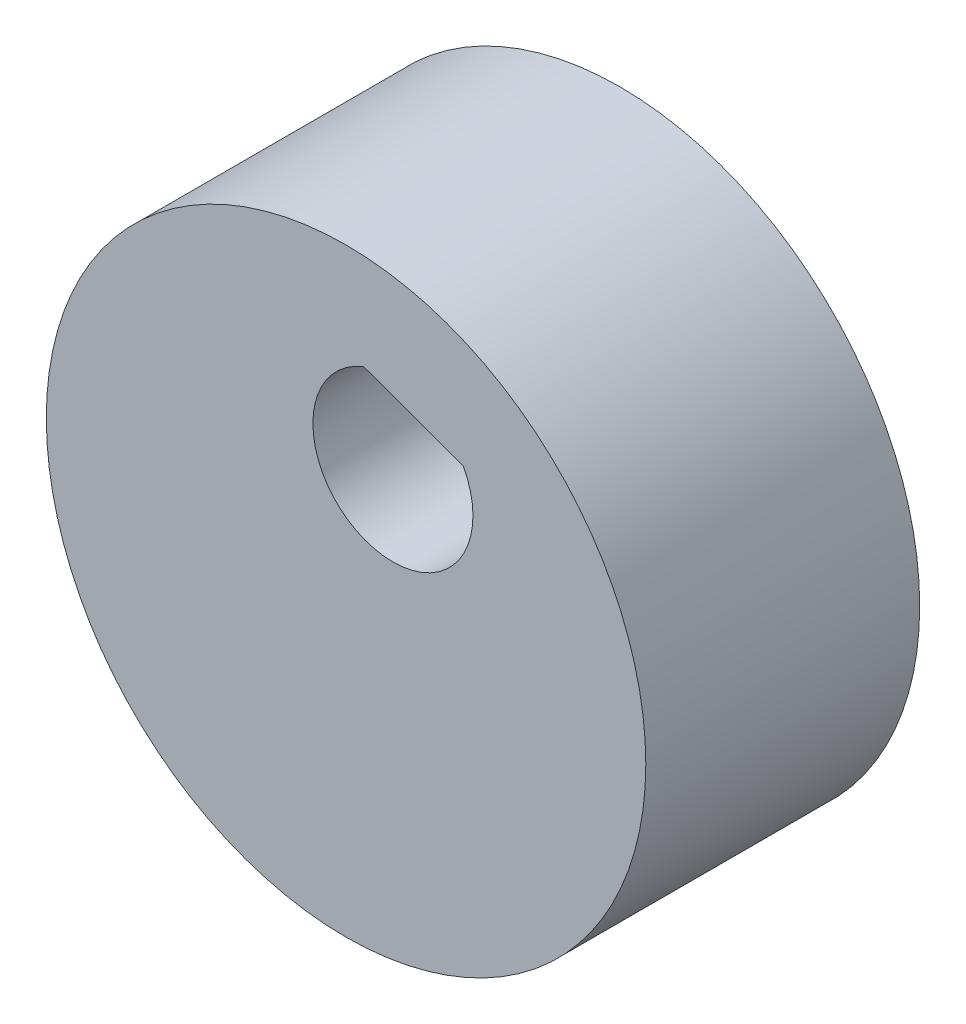
ISO-10303-21;
HEADER;
FILE_DESCRIPTION(('STEP AP214'),'2;1');
FILE_NAME('part.step','',(''),(''),'','','');
FILE_SCHEMA(('AUTOMOTIVE_DESIGN { 1 0 10303 214 1 1 1 1 }'));
ENDSEC;
DATA;
#1=APPLICATION_CONTEXT('core data for automotive mechanical design processes');
#2=APPLICATION_PROTOCOL_DEFINITION('international standard','automotive_design',2000,#1);
#3=PRODUCT_CONTEXT('',#1,'mechanical');
#4=PRODUCT('Part','Part','',(#3));
#5=PRODUCT_RELATED_PRODUCT_CATEGORY('part','',(#4));
#6=PRODUCT_DEFINITION_FORMATION('','',#4);
#7=PRODUCT_DEFINITION_CONTEXT('part definition',#1,'design');
#8=PRODUCT_DEFINITION('design','',#6,#7);
#9=PRODUCT_DEFINITION_SHAPE('','',#8);
#10=(LENGTH_UNIT() NAMED_UNIT(*) SI_UNIT(.MILLI.,.METRE.));
#11=(NAMED_UNIT(*) PLANE_ANGLE_UNIT() SI_UNIT($,.RADIAN.));
#12=(NAMED_UNIT(*) SI_UNIT($,.STERADIAN.) SOLID_ANGLE_UNIT());
#13=UNCERTAINTY_MEASURE_WITH_UNIT(LENGTH_MEASURE(1.E-05),#10,'distance_accuracy_value','');
#14=(GEOMETRIC_REPRESENTATION_CONTEXT(3) GLOBAL_UNCERTAINTY_ASSIGNED_CONTEXT((#13)) GLOBAL_UNIT_ASSIGNED_CONTEXT((#10,
#11,#12)) REPRESENTATION_CONTEXT('',''));
#15=CARTESIAN_POINT('',(0.,0.,0.));
#16=DIRECTION('',(0.,0.,1.));
#17=DIRECTION('',(1.,0.,0.));
#18=AXIS2_PLACEMENT_3D('',#15,#16,#17);
#19=CARTESIAN_POINT('',(-19.4680004808592,-35.2733524863187,90.6003228274378));
#20=DIRECTION('',(-0.342213757644624,-0.939622128346681,0.));
#21=DIRECTION('',(0.939622128346681,-0.342213757644624,0.));
#22=AXIS2_PLACEMENT_3D('',#19,#20,#21);
#23=PLANE('',#22);
#24=DIRECTION('',(0.,0.,-1.));
#25=VECTOR('',#24,1.);
#26=CARTESIAN_POINT('',(-21.1052094666073,-34.6770750869686,90.6003228274378));
#27=LINE('',#26,#25);
#28=CARTESIAN_POINT('',(-21.1052094666073,-34.6770750869686,62.7403156486879));
#29=VERTEX_POINT('',#28);
#30=CARTESIAN_POINT('',(-21.1052094666073,-34.6770750869686,54.7403156486879));
#31=VERTEX_POINT('',#30);
#32=EDGE_CURVE('E74',#29,#31,#27,.T.);
#33=ORIENTED_EDGE('',*,*,#32,.T.);
#34=DIRECTION('',(0.939622128346681,-0.342213757644624,0.));
#35=VECTOR('',#34,1.);
#36=CARTESIAN_POINT('',(-19.4680004808592,-35.2733524863187,54.7403156486879));
#37=LINE('',#36,#35);
#38=CARTESIAN_POINT('',(-17.8307914951058,-35.8696298856708,54.7403156486879));
#39=VERTEX_POINT('',#38);
#40=EDGE_CURVE('E65',#31,#39,#37,.T.);
#41=ORIENTED_EDGE('',*,*,#40,.T.);
#42=DIRECTION('',(0.,0.,-1.));
#43=VECTOR('',#42,1.);
#44=CARTESIAN_POINT('',(-17.8307914951058,-35.8696298856708,90.6003228274378));
#45=LINE('',#44,#43);
#46=CARTESIAN_POINT('',(-17.8307914951058,-35.8696298856708,62.7403156486879));
#47=VERTEX_POINT('',#46);
#48=EDGE_CURVE('E75',#47,#39,#45,.T.);
#49=ORIENTED_EDGE('',*,*,#48,.F.);
#50=DIRECTION('',(-0.939622128346681,0.342213757644624,0.));
#51=VECTOR('',#50,1.);
#52=CARTESIAN_POINT('',(-19.4680004808592,-35.2733524863187,62.7403156486879));
#53=LINE('',#52,#51);
#54=EDGE_CURVE('E11',#47,#29,#53,.T.);
#55=ORIENTED_EDGE('',*,*,#54,.T.);
#56=EDGE_LOOP('',(#33,#41,#49,#55));
#57=FACE_BOUND('',#56,.T.);
#58=ADVANCED_FACE('F39',(#57),#23,.T.);
#59=CARTESIAN_POINT('',(-21.6821234928173,-41.3527076567227,90.6003228274378));
#60=DIRECTION('',(0.,0.,-1.));
#61=DIRECTION('',(-1.,0.,0.));
#62=AXIS2_PLACEMENT_3D('',#59,#60,#61);
#63=CYLINDRICAL_SURFACE('',#62,9.85);
#64=CARTESIAN_POINT('',(-21.6821234928173,-41.3527076567227,53.7403156486879));
#65=DIRECTION('',(0.,0.,-1.));
#66=DIRECTION('',(-1.,0.,0.));
#67=AXIS2_PLACEMENT_3D('',#64,#65,#66);
#68=CIRCLE('',#67,9.85);
#69=CARTESIAN_POINT('',(-31.5321234928173,-41.3527076567227,53.7403156486879));
#70=VERTEX_POINT('',#69);
#71=EDGE_CURVE('E47',#70,#70,#68,.T.);
#72=ORIENTED_EDGE('',*,*,#71,.F.);
#73=EDGE_LOOP('',(#72));
#74=FACE_BOUND('',#73,.T.);
#75=CARTESIAN_POINT('',(-21.6821234928173,-41.3527076567227,62.7403156486879));
#76=DIRECTION('',(0.,0.,1.));
#77=DIRECTION('',(1.,0.,0.));
#78=AXIS2_PLACEMENT_3D('',#75,#76,#77);
#79=CIRCLE('',#78,9.85);
#80=CARTESIAN_POINT('',(-11.8321234928173,-41.3527076567227,62.7403156486879));
#81=VERTEX_POINT('',#80);
#82=EDGE_CURVE('E81',#81,#81,#79,.F.);
#83=ORIENTED_EDGE('',*,*,#82,.T.);
#84=EDGE_LOOP('',(#83));
#85=FACE_BOUND('',#84,.T.);
#86=ADVANCED_FACE('F41',(#74,#85),#63,.T.);
#87=CARTESIAN_POINT('',(-21.6821234928173,-41.3527076567227,53.7403156486879));
#88=DIRECTION('',(0.,0.,-1.));
#89=DIRECTION('',(-1.,0.,0.));
#90=AXIS2_PLACEMENT_3D('',#87,#88,#89);
#91=PLANE('',#90);
#92=CARTESIAN_POINT('',(-20.1421615834165,-37.1244080791627,53.7403156486879));
#93=DIRECTION('',(0.,0.,-1.));
#94=DIRECTION('',(-1.,0.,0.));
#95=AXIS2_PLACEMENT_3D('',#92,#93,#94);
#96=CIRCLE('',#95,2.63);
#97=CARTESIAN_POINT('',(-22.7721615834165,-37.1244080791627,53.7403156486879));
#98=VERTEX_POINT('',#97);
#99=EDGE_CURVE('E77',#98,#98,#96,.T.);
#100=ORIENTED_EDGE('',*,*,#99,.F.);
#101=EDGE_LOOP('',(#100));
#102=FACE_BOUND('',#101,.T.);
#103=ORIENTED_EDGE('',*,*,#71,.T.);
#104=EDGE_LOOP('',(#103));
#105=FACE_BOUND('',#104,.T.);
#106=ADVANCED_FACE('F86',(#102,#105),#91,.T.);
#107=CARTESIAN_POINT('',(-20.1421615834165,-37.1244080791627,90.6003228274378));
#108=DIRECTION('',(0.,0.,-1.));
#109=DIRECTION('',(-1.,0.,0.));
#110=AXIS2_PLACEMENT_3D('',#107,#108,#109);
#111=CYLINDRICAL_SURFACE('',#110,2.63);
#112=ORIENTED_EDGE('',*,*,#99,.T.);
#113=EDGE_LOOP('',(#112));
#114=FACE_BOUND('',#113,.T.);
#115=CARTESIAN_POINT('',(-20.1421615834165,-37.1244080791627,54.7403156486879));
#116=DIRECTION('',(0.,0.,-1.));
#117=DIRECTION('',(-1.,0.,0.));
#118=AXIS2_PLACEMENT_3D('',#115,#116,#117);
#119=CIRCLE('',#118,2.63);
#120=EDGE_CURVE('E53',#31,#39,#119,.T.);
#121=ORIENTED_EDGE('',*,*,#120,.F.);
#122=ORIENTED_EDGE('',*,*,#32,.F.);
#123=CARTESIAN_POINT('',(-20.1421615834165,-37.1244080791627,62.7403156486879));
#124=DIRECTION('',(0.,0.,1.));
#125=DIRECTION('',(1.,0.,0.));
#126=AXIS2_PLACEMENT_3D('',#123,#124,#125);
#127=CIRCLE('',#126,2.63);
#128=EDGE_CURVE('E60',#47,#29,#127,.F.);
#129=ORIENTED_EDGE('',*,*,#128,.F.);
#130=ORIENTED_EDGE('',*,*,#48,.T.);
#131=EDGE_LOOP('',(#121,#122,#129,#130));
#132=FACE_BOUND('',#131,.T.);
#133=ADVANCED_FACE('F73',(#114,#132),#111,.F.);
#134=CARTESIAN_POINT('',(-0.99960781150963,-109.660632357086,62.7403156486878));
#135=DIRECTION('',(0.,0.,1.));
#136=DIRECTION('',(0.961322894900142,0.275423840182382,0.));
#137=AXIS2_PLACEMENT_3D('',#134,#135,#136);
#138=PLANE('',#137);
#139=ORIENTED_EDGE('',*,*,#82,.F.);
#140=EDGE_LOOP('',(#139));
#141=FACE_BOUND('',#140,.T.);
#142=ORIENTED_EDGE('',*,*,#54,.F.);
#143=ORIENTED_EDGE('',*,*,#128,.T.);
#144=EDGE_LOOP('',(#142,#143));
#145=FACE_BOUND('',#144,.T.);
#146=ADVANCED_FACE('F95',(#141,#145),#138,.T.);
#147=CARTESIAN_POINT('',(-20.1421615834165,-37.1244080791627,54.7403156486879));
#148=DIRECTION('',(0.,0.,-1.));
#149=DIRECTION('',(-1.,0.,0.));
#150=AXIS2_PLACEMENT_3D('',#147,#148,#149);
#151=PLANE('',#150);
#152=ORIENTED_EDGE('',*,*,#120,.T.);
#153=ORIENTED_EDGE('',*,*,#40,.F.);
#154=EDGE_LOOP('',(#152,#153));
#155=FACE_BOUND('',#154,.T.);
#156=ADVANCED_FACE('F66',(#155),#151,.T.);
#157=CLOSED_SHELL('',(#58,#86,#106,#133,#146,#156));
#158=MANIFOLD_SOLID_BREP('B2',#157);
#159=ADVANCED_BREP_SHAPE_REPRESENTATION('',(#18,#158),#14);
#160=SHAPE_DEFINITION_REPRESENTATION(#9,#159);
ENDSEC;
END-ISO-10303-21;
